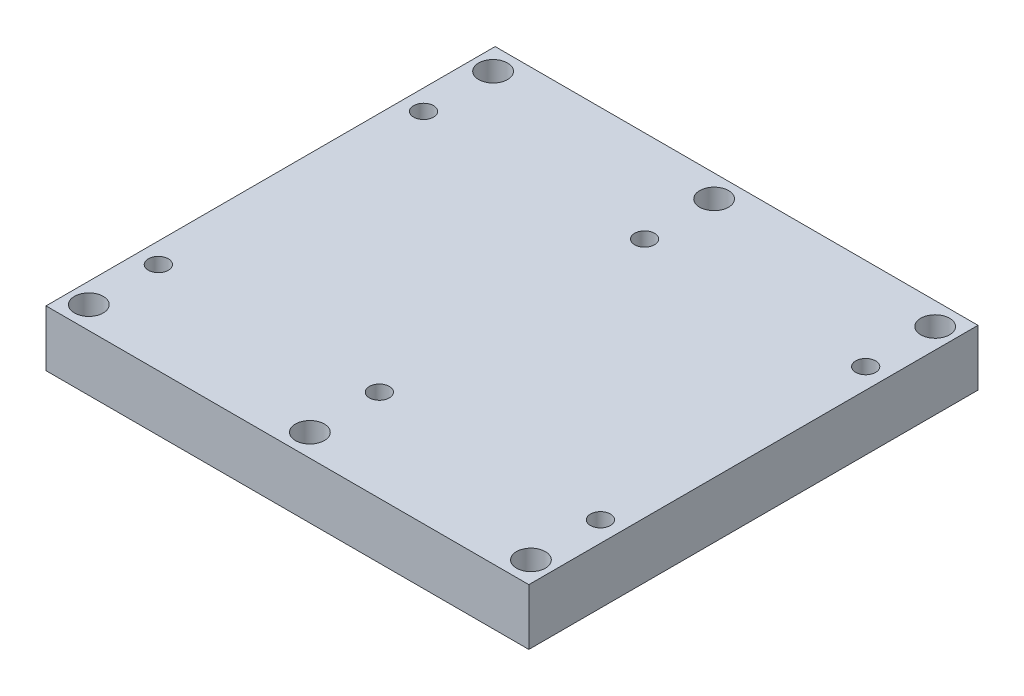
ISO-10303-21;
HEADER;
FILE_DESCRIPTION(('STEP AP214'),'2;1');
FILE_NAME('part.step','',(''),(''),'','','');
FILE_SCHEMA(('AUTOMOTIVE_DESIGN { 1 0 10303 214 1 1 1 1 }'));
ENDSEC;
DATA;
#1=APPLICATION_CONTEXT('core data for automotive mechanical design processes');
#2=APPLICATION_PROTOCOL_DEFINITION('international standard','automotive_design',2000,#1);
#3=PRODUCT_CONTEXT('',#1,'mechanical');
#4=PRODUCT('Part','Part','',(#3));
#5=PRODUCT_RELATED_PRODUCT_CATEGORY('part','',(#4));
#6=PRODUCT_DEFINITION_FORMATION('','',#4);
#7=PRODUCT_DEFINITION_CONTEXT('part definition',#1,'design');
#8=PRODUCT_DEFINITION('design','',#6,#7);
#9=PRODUCT_DEFINITION_SHAPE('','',#8);
#10=(LENGTH_UNIT() NAMED_UNIT(*) SI_UNIT(.MILLI.,.METRE.));
#11=(NAMED_UNIT(*) PLANE_ANGLE_UNIT() SI_UNIT($,.RADIAN.));
#12=(NAMED_UNIT(*) SI_UNIT($,.STERADIAN.) SOLID_ANGLE_UNIT());
#13=UNCERTAINTY_MEASURE_WITH_UNIT(LENGTH_MEASURE(1.E-05),#10,'distance_accuracy_value','');
#14=(GEOMETRIC_REPRESENTATION_CONTEXT(3) GLOBAL_UNCERTAINTY_ASSIGNED_CONTEXT((#13)) GLOBAL_UNIT_ASSIGNED_CONTEXT((#10,
#11,#12)) REPRESENTATION_CONTEXT('',''));
#15=CARTESIAN_POINT('',(0.,0.,0.));
#16=DIRECTION('',(0.,0.,1.));
#17=DIRECTION('',(1.,0.,0.));
#18=AXIS2_PLACEMENT_3D('',#15,#16,#17);
#19=CARTESIAN_POINT('',(0.,6.35,0.));
#20=DIRECTION('',(0.,-1.,0.));
#21=DIRECTION('',(0.,0.,-1.));
#22=AXIS2_PLACEMENT_3D('',#19,#20,#21);
#23=PLANE('',#22);
#24=CARTESIAN_POINT('',(0.,6.35,-22.86));
#25=DIRECTION('',(0.,1.,0.));
#26=DIRECTION('',(0.,0.,1.));
#27=AXIS2_PLACEMENT_3D('',#24,#25,#26);
#28=CIRCLE('',#27,1.63195);
#29=CARTESIAN_POINT('',(0.,6.35,-21.22805));
#30=VERTEX_POINT('',#29);
#31=EDGE_CURVE('E183',#30,#30,#28,.T.);
#32=ORIENTED_EDGE('',*,*,#31,.F.);
#33=EDGE_LOOP('',(#32));
#34=FACE_BOUND('',#33,.T.);
#35=CARTESIAN_POINT('',(25.,6.35,-22.86));
#36=DIRECTION('',(0.,1.,0.));
#37=DIRECTION('',(0.,0.,1.));
#38=AXIS2_PLACEMENT_3D('',#35,#36,#37);
#39=CIRCLE('',#38,1.63195);
#40=CARTESIAN_POINT('',(25.,6.35,-21.22805));
#41=VERTEX_POINT('',#40);
#42=EDGE_CURVE('E177',#41,#41,#39,.T.);
#43=ORIENTED_EDGE('',*,*,#42,.F.);
#44=EDGE_LOOP('',(#43));
#45=FACE_BOUND('',#44,.T.);
#46=CARTESIAN_POINT('',(-25.,6.35,14.9999908));
#47=DIRECTION('',(0.,1.,0.));
#48=DIRECTION('',(0.,0.,1.));
#49=AXIS2_PLACEMENT_3D('',#46,#47,#48);
#50=CIRCLE('',#49,1.1303);
#51=CARTESIAN_POINT('',(-25.,6.35,16.1302908));
#52=VERTEX_POINT('',#51);
#53=EDGE_CURVE('E123',#52,#52,#50,.T.);
#54=ORIENTED_EDGE('',*,*,#53,.F.);
#55=EDGE_LOOP('',(#54));
#56=FACE_BOUND('',#55,.T.);
#57=DIRECTION('',(0.,0.,-1.));
#58=VECTOR('',#57,1.);
#59=CARTESIAN_POINT('',(27.305,6.35,25.4));
#60=LINE('',#59,#58);
#61=CARTESIAN_POINT('',(27.305,6.35,25.4));
#62=VERTEX_POINT('',#61);
#63=CARTESIAN_POINT('',(27.305,6.35,-25.4));
#64=VERTEX_POINT('',#63);
#65=EDGE_CURVE('E95',#62,#64,#60,.T.);
#66=ORIENTED_EDGE('',*,*,#65,.T.);
#67=DIRECTION('',(-1.,0.,0.));
#68=VECTOR('',#67,1.);
#69=CARTESIAN_POINT('',(-27.305,6.35,-25.4));
#70=LINE('',#69,#68);
#71=CARTESIAN_POINT('',(-27.305,6.35,-25.4));
#72=VERTEX_POINT('',#71);
#73=EDGE_CURVE('E90',#64,#72,#70,.T.);
#74=ORIENTED_EDGE('',*,*,#73,.T.);
#75=DIRECTION('',(0.,0.,1.));
#76=VECTOR('',#75,1.);
#77=CARTESIAN_POINT('',(-27.305,6.35,25.4));
#78=LINE('',#77,#76);
#79=CARTESIAN_POINT('',(-27.305,6.35,25.4));
#80=VERTEX_POINT('',#79);
#81=EDGE_CURVE('E93',#72,#80,#78,.T.);
#82=ORIENTED_EDGE('',*,*,#81,.T.);
#83=DIRECTION('',(1.,0.,0.));
#84=VECTOR('',#83,1.);
#85=CARTESIAN_POINT('',(-27.305,6.35,25.4));
#86=LINE('',#85,#84);
#87=EDGE_CURVE('E60',#80,#62,#86,.T.);
#88=ORIENTED_EDGE('',*,*,#87,.T.);
#89=EDGE_LOOP('',(#66,#74,#82,#88));
#90=FACE_BOUND('',#89,.T.);
#91=CARTESIAN_POINT('',(25.0000016,6.35,14.9999908));
#92=DIRECTION('',(0.,1.,0.));
#93=DIRECTION('',(0.,0.,1.));
#94=AXIS2_PLACEMENT_3D('',#91,#92,#93);
#95=CIRCLE('',#94,1.1303);
#96=CARTESIAN_POINT('',(25.0000016,6.35,16.1302908));
#97=VERTEX_POINT('',#96);
#98=EDGE_CURVE('E129',#97,#97,#95,.T.);
#99=ORIENTED_EDGE('',*,*,#98,.F.);
#100=EDGE_LOOP('',(#99));
#101=FACE_BOUND('',#100,.T.);
#102=CARTESIAN_POINT('',(7.99999996803358E-07,6.35,14.9999908));
#103=DIRECTION('',(0.,1.,0.));
#104=DIRECTION('',(0.,0.,1.));
#105=AXIS2_PLACEMENT_3D('',#102,#103,#104);
#106=CIRCLE('',#105,1.1303);
#107=CARTESIAN_POINT('',(7.99999996803358E-07,6.35,16.1302908));
#108=VERTEX_POINT('',#107);
#109=EDGE_CURVE('E135',#108,#108,#106,.T.);
#110=ORIENTED_EDGE('',*,*,#109,.F.);
#111=EDGE_LOOP('',(#110));
#112=FACE_BOUND('',#111,.T.);
#113=CARTESIAN_POINT('',(25.0000016,6.35,-15.));
#114=DIRECTION('',(0.,1.,0.));
#115=DIRECTION('',(0.,0.,1.));
#116=AXIS2_PLACEMENT_3D('',#113,#114,#115);
#117=CIRCLE('',#116,1.1303);
#118=CARTESIAN_POINT('',(25.0000016,6.35,-13.8697));
#119=VERTEX_POINT('',#118);
#120=EDGE_CURVE('E141',#119,#119,#117,.T.);
#121=ORIENTED_EDGE('',*,*,#120,.F.);
#122=EDGE_LOOP('',(#121));
#123=FACE_BOUND('',#122,.T.);
#124=CARTESIAN_POINT('',(7.99999996803358E-07,6.35,-15.));
#125=DIRECTION('',(0.,1.,0.));
#126=DIRECTION('',(0.,0.,1.));
#127=AXIS2_PLACEMENT_3D('',#124,#125,#126);
#128=CIRCLE('',#127,1.1303);
#129=CARTESIAN_POINT('',(7.99999996803358E-07,6.35,-13.8697));
#130=VERTEX_POINT('',#129);
#131=EDGE_CURVE('E147',#130,#130,#128,.T.);
#132=ORIENTED_EDGE('',*,*,#131,.F.);
#133=EDGE_LOOP('',(#132));
#134=FACE_BOUND('',#133,.T.);
#135=CARTESIAN_POINT('',(-25.,6.35,-15.));
#136=DIRECTION('',(0.,1.,0.));
#137=DIRECTION('',(0.,0.,1.));
#138=AXIS2_PLACEMENT_3D('',#135,#136,#137);
#139=CIRCLE('',#138,1.1303);
#140=CARTESIAN_POINT('',(-25.,6.35,-13.8697));
#141=VERTEX_POINT('',#140);
#142=EDGE_CURVE('E153',#141,#141,#139,.T.);
#143=ORIENTED_EDGE('',*,*,#142,.F.);
#144=EDGE_LOOP('',(#143));
#145=FACE_BOUND('',#144,.T.);
#146=CARTESIAN_POINT('',(-24.9999999999995,6.35,22.86));
#147=DIRECTION('',(0.,1.,0.));
#148=DIRECTION('',(0.,0.,1.));
#149=AXIS2_PLACEMENT_3D('',#146,#147,#148);
#150=CIRCLE('',#149,1.63195);
#151=CARTESIAN_POINT('',(-24.9999999999995,6.35,24.49195));
#152=VERTEX_POINT('',#151);
#153=EDGE_CURVE('E159',#152,#152,#150,.T.);
#154=ORIENTED_EDGE('',*,*,#153,.F.);
#155=EDGE_LOOP('',(#154));
#156=FACE_BOUND('',#155,.T.);
#157=CARTESIAN_POINT('',(25.0000000000005,6.35,22.86));
#158=DIRECTION('',(0.,1.,0.));
#159=DIRECTION('',(0.,0.,1.));
#160=AXIS2_PLACEMENT_3D('',#157,#158,#159);
#161=CIRCLE('',#160,1.63195);
#162=CARTESIAN_POINT('',(25.0000000000005,6.35,24.49195));
#163=VERTEX_POINT('',#162);
#164=EDGE_CURVE('E165',#163,#163,#161,.T.);
#165=ORIENTED_EDGE('',*,*,#164,.F.);
#166=EDGE_LOOP('',(#165));
#167=FACE_BOUND('',#166,.T.);
#168=CARTESIAN_POINT('',(4.71844785465692E-13,6.35,22.86));
#169=DIRECTION('',(0.,1.,0.));
#170=DIRECTION('',(0.,0.,1.));
#171=AXIS2_PLACEMENT_3D('',#168,#169,#170);
#172=CIRCLE('',#171,1.63195);
#173=CARTESIAN_POINT('',(4.71844785465692E-13,6.35,24.49195));
#174=VERTEX_POINT('',#173);
#175=EDGE_CURVE('E171',#174,#174,#172,.T.);
#176=ORIENTED_EDGE('',*,*,#175,.F.);
#177=EDGE_LOOP('',(#176));
#178=FACE_BOUND('',#177,.T.);
#179=CARTESIAN_POINT('',(-25.,6.35,-22.86));
#180=DIRECTION('',(0.,1.,0.));
#181=DIRECTION('',(0.,0.,1.));
#182=AXIS2_PLACEMENT_3D('',#179,#180,#181);
#183=CIRCLE('',#182,1.63195);
#184=CARTESIAN_POINT('',(-25.,6.35,-21.22805));
#185=VERTEX_POINT('',#184);
#186=EDGE_CURVE('E189',#185,#185,#183,.T.);
#187=ORIENTED_EDGE('',*,*,#186,.F.);
#188=EDGE_LOOP('',(#187));
#189=FACE_BOUND('',#188,.T.);
#190=ADVANCED_FACE('F43',(#34,#45,#56,#90,#101,#112,#123,#134,#145,#156,#167,#178,#189),#23,.F.);
#191=CARTESIAN_POINT('',(27.305,6.35,25.4));
#192=DIRECTION('',(-1.,0.,0.));
#193=DIRECTION('',(0.,0.,1.));
#194=AXIS2_PLACEMENT_3D('',#191,#192,#193);
#195=PLANE('',#194);
#196=DIRECTION('',(0.,0.,-1.));
#197=VECTOR('',#196,1.);
#198=CARTESIAN_POINT('',(27.305,0.,25.4));
#199=LINE('',#198,#197);
#200=CARTESIAN_POINT('',(27.305,0.,25.4));
#201=VERTEX_POINT('',#200);
#202=CARTESIAN_POINT('',(27.305,0.,-25.4));
#203=VERTEX_POINT('',#202);
#204=EDGE_CURVE('E107',#201,#203,#199,.T.);
#205=ORIENTED_EDGE('',*,*,#204,.T.);
#206=DIRECTION('',(0.,-1.,0.));
#207=VECTOR('',#206,1.);
#208=CARTESIAN_POINT('',(27.305,6.35,-25.4));
#209=LINE('',#208,#207);
#210=EDGE_CURVE('E11',#64,#203,#209,.T.);
#211=ORIENTED_EDGE('',*,*,#210,.F.);
#212=ORIENTED_EDGE('',*,*,#65,.F.);
#213=DIRECTION('',(0.,-1.,0.));
#214=VECTOR('',#213,1.);
#215=CARTESIAN_POINT('',(27.305,6.35,25.4));
#216=LINE('',#215,#214);
#217=EDGE_CURVE('E103',#62,#201,#216,.T.);
#218=ORIENTED_EDGE('',*,*,#217,.T.);
#219=EDGE_LOOP('',(#205,#211,#212,#218));
#220=FACE_BOUND('',#219,.T.);
#221=ADVANCED_FACE('F45',(#220),#195,.F.);
#222=CARTESIAN_POINT('',(-27.305,6.35,-25.4));
#223=DIRECTION('',(0.,0.,1.));
#224=DIRECTION('',(1.,0.,0.));
#225=AXIS2_PLACEMENT_3D('',#222,#223,#224);
#226=PLANE('',#225);
#227=DIRECTION('',(-1.,0.,0.));
#228=VECTOR('',#227,1.);
#229=CARTESIAN_POINT('',(-27.305,0.,-25.4));
#230=LINE('',#229,#228);
#231=CARTESIAN_POINT('',(-27.305,0.,-25.4));
#232=VERTEX_POINT('',#231);
#233=EDGE_CURVE('E99',#203,#232,#230,.T.);
#234=ORIENTED_EDGE('',*,*,#233,.T.);
#235=DIRECTION('',(0.,-1.,0.));
#236=VECTOR('',#235,1.);
#237=CARTESIAN_POINT('',(-27.305,6.35,-25.4));
#238=LINE('',#237,#236);
#239=EDGE_CURVE('E52',#72,#232,#238,.T.);
#240=ORIENTED_EDGE('',*,*,#239,.F.);
#241=ORIENTED_EDGE('',*,*,#73,.F.);
#242=ORIENTED_EDGE('',*,*,#210,.T.);
#243=EDGE_LOOP('',(#234,#240,#241,#242));
#244=FACE_BOUND('',#243,.T.);
#245=ADVANCED_FACE('F98',(#244),#226,.F.);
#246=CARTESIAN_POINT('',(-27.305,6.35,25.4));
#247=DIRECTION('',(1.,0.,0.));
#248=DIRECTION('',(0.,0.,-1.));
#249=AXIS2_PLACEMENT_3D('',#246,#247,#248);
#250=PLANE('',#249);
#251=DIRECTION('',(0.,0.,1.));
#252=VECTOR('',#251,1.);
#253=CARTESIAN_POINT('',(-27.305,0.,25.4));
#254=LINE('',#253,#252);
#255=CARTESIAN_POINT('',(-27.305,0.,25.4));
#256=VERTEX_POINT('',#255);
#257=EDGE_CURVE('E77',#232,#256,#254,.T.);
#258=ORIENTED_EDGE('',*,*,#257,.T.);
#259=DIRECTION('',(0.,-1.,0.));
#260=VECTOR('',#259,1.);
#261=CARTESIAN_POINT('',(-27.305,6.35,25.4));
#262=LINE('',#261,#260);
#263=EDGE_CURVE('E100',#80,#256,#262,.T.);
#264=ORIENTED_EDGE('',*,*,#263,.F.);
#265=ORIENTED_EDGE('',*,*,#81,.F.);
#266=ORIENTED_EDGE('',*,*,#239,.T.);
#267=EDGE_LOOP('',(#258,#264,#265,#266));
#268=FACE_BOUND('',#267,.T.);
#269=ADVANCED_FACE('F101',(#268),#250,.F.);
#270=CARTESIAN_POINT('',(-27.305,6.35,25.4));
#271=DIRECTION('',(0.,0.,-1.));
#272=DIRECTION('',(-1.,0.,0.));
#273=AXIS2_PLACEMENT_3D('',#270,#271,#272);
#274=PLANE('',#273);
#275=DIRECTION('',(1.,0.,0.));
#276=VECTOR('',#275,1.);
#277=CARTESIAN_POINT('',(-27.305,0.,25.4));
#278=LINE('',#277,#276);
#279=EDGE_CURVE('E83',#256,#201,#278,.T.);
#280=ORIENTED_EDGE('',*,*,#279,.T.);
#281=ORIENTED_EDGE('',*,*,#217,.F.);
#282=ORIENTED_EDGE('',*,*,#87,.F.);
#283=ORIENTED_EDGE('',*,*,#263,.T.);
#284=EDGE_LOOP('',(#280,#281,#282,#283));
#285=FACE_BOUND('',#284,.T.);
#286=ADVANCED_FACE('F115',(#285),#274,.F.);
#287=CARTESIAN_POINT('',(0.,0.,0.));
#288=DIRECTION('',(0.,-1.,0.));
#289=DIRECTION('',(0.,0.,-1.));
#290=AXIS2_PLACEMENT_3D('',#287,#288,#289);
#291=PLANE('',#290);
#292=CARTESIAN_POINT('',(-25.,0.,-22.86));
#293=DIRECTION('',(0.,-1.,0.));
#294=DIRECTION('',(0.,0.,-1.));
#295=AXIS2_PLACEMENT_3D('',#292,#293,#294);
#296=CIRCLE('',#295,1.63195);
#297=CARTESIAN_POINT('',(-25.,0.,-24.49195));
#298=VERTEX_POINT('',#297);
#299=EDGE_CURVE('E186',#298,#298,#296,.T.);
#300=ORIENTED_EDGE('',*,*,#299,.F.);
#301=EDGE_LOOP('',(#300));
#302=FACE_BOUND('',#301,.T.);
#303=CARTESIAN_POINT('',(0.,0.,-22.86));
#304=DIRECTION('',(0.,-1.,0.));
#305=DIRECTION('',(0.,0.,-1.));
#306=AXIS2_PLACEMENT_3D('',#303,#304,#305);
#307=CIRCLE('',#306,1.63195);
#308=CARTESIAN_POINT('',(0.,0.,-24.49195));
#309=VERTEX_POINT('',#308);
#310=EDGE_CURVE('E180',#309,#309,#307,.T.);
#311=ORIENTED_EDGE('',*,*,#310,.F.);
#312=EDGE_LOOP('',(#311));
#313=FACE_BOUND('',#312,.T.);
#314=CARTESIAN_POINT('',(25.,0.,-22.86));
#315=DIRECTION('',(0.,-1.,0.));
#316=DIRECTION('',(0.,0.,-1.));
#317=AXIS2_PLACEMENT_3D('',#314,#315,#316);
#318=CIRCLE('',#317,1.63195);
#319=CARTESIAN_POINT('',(25.,0.,-24.49195));
#320=VERTEX_POINT('',#319);
#321=EDGE_CURVE('E174',#320,#320,#318,.T.);
#322=ORIENTED_EDGE('',*,*,#321,.F.);
#323=EDGE_LOOP('',(#322));
#324=FACE_BOUND('',#323,.T.);
#325=CARTESIAN_POINT('',(4.71844785465692E-13,0.,22.86));
#326=DIRECTION('',(0.,-1.,0.));
#327=DIRECTION('',(0.,0.,-1.));
#328=AXIS2_PLACEMENT_3D('',#325,#326,#327);
#329=CIRCLE('',#328,1.63195);
#330=CARTESIAN_POINT('',(4.71844785465692E-13,0.,21.22805));
#331=VERTEX_POINT('',#330);
#332=EDGE_CURVE('E168',#331,#331,#329,.T.);
#333=ORIENTED_EDGE('',*,*,#332,.F.);
#334=EDGE_LOOP('',(#333));
#335=FACE_BOUND('',#334,.T.);
#336=CARTESIAN_POINT('',(25.0000000000005,0.,22.86));
#337=DIRECTION('',(0.,-1.,0.));
#338=DIRECTION('',(0.,0.,-1.));
#339=AXIS2_PLACEMENT_3D('',#336,#337,#338);
#340=CIRCLE('',#339,1.63195);
#341=CARTESIAN_POINT('',(25.0000000000005,0.,21.22805));
#342=VERTEX_POINT('',#341);
#343=EDGE_CURVE('E162',#342,#342,#340,.T.);
#344=ORIENTED_EDGE('',*,*,#343,.F.);
#345=EDGE_LOOP('',(#344));
#346=FACE_BOUND('',#345,.T.);
#347=CARTESIAN_POINT('',(-24.9999999999995,0.,22.86));
#348=DIRECTION('',(0.,-1.,0.));
#349=DIRECTION('',(0.,0.,-1.));
#350=AXIS2_PLACEMENT_3D('',#347,#348,#349);
#351=CIRCLE('',#350,1.63195);
#352=CARTESIAN_POINT('',(-24.9999999999995,0.,21.22805));
#353=VERTEX_POINT('',#352);
#354=EDGE_CURVE('E156',#353,#353,#351,.T.);
#355=ORIENTED_EDGE('',*,*,#354,.F.);
#356=EDGE_LOOP('',(#355));
#357=FACE_BOUND('',#356,.T.);
#358=CARTESIAN_POINT('',(-25.,0.,-15.));
#359=DIRECTION('',(0.,-1.,0.));
#360=DIRECTION('',(0.,0.,-1.));
#361=AXIS2_PLACEMENT_3D('',#358,#359,#360);
#362=CIRCLE('',#361,1.1303);
#363=CARTESIAN_POINT('',(-25.,0.,-16.1303));
#364=VERTEX_POINT('',#363);
#365=EDGE_CURVE('E150',#364,#364,#362,.T.);
#366=ORIENTED_EDGE('',*,*,#365,.F.);
#367=EDGE_LOOP('',(#366));
#368=FACE_BOUND('',#367,.T.);
#369=CARTESIAN_POINT('',(7.99999996803358E-07,0.,-15.));
#370=DIRECTION('',(0.,-1.,0.));
#371=DIRECTION('',(0.,0.,-1.));
#372=AXIS2_PLACEMENT_3D('',#369,#370,#371);
#373=CIRCLE('',#372,1.1303);
#374=CARTESIAN_POINT('',(7.99999996803358E-07,0.,-16.1303));
#375=VERTEX_POINT('',#374);
#376=EDGE_CURVE('E144',#375,#375,#373,.T.);
#377=ORIENTED_EDGE('',*,*,#376,.F.);
#378=EDGE_LOOP('',(#377));
#379=FACE_BOUND('',#378,.T.);
#380=CARTESIAN_POINT('',(25.0000016,0.,-15.));
#381=DIRECTION('',(0.,-1.,0.));
#382=DIRECTION('',(0.,0.,-1.));
#383=AXIS2_PLACEMENT_3D('',#380,#381,#382);
#384=CIRCLE('',#383,1.1303);
#385=CARTESIAN_POINT('',(25.0000016,0.,-16.1303));
#386=VERTEX_POINT('',#385);
#387=EDGE_CURVE('E138',#386,#386,#384,.T.);
#388=ORIENTED_EDGE('',*,*,#387,.F.);
#389=EDGE_LOOP('',(#388));
#390=FACE_BOUND('',#389,.T.);
#391=CARTESIAN_POINT('',(7.99999996803358E-07,0.,14.9999908));
#392=DIRECTION('',(0.,-1.,0.));
#393=DIRECTION('',(0.,0.,-1.));
#394=AXIS2_PLACEMENT_3D('',#391,#392,#393);
#395=CIRCLE('',#394,1.1303);
#396=CARTESIAN_POINT('',(7.99999996803358E-07,0.,13.8696908));
#397=VERTEX_POINT('',#396);
#398=EDGE_CURVE('E132',#397,#397,#395,.T.);
#399=ORIENTED_EDGE('',*,*,#398,.F.);
#400=EDGE_LOOP('',(#399));
#401=FACE_BOUND('',#400,.T.);
#402=CARTESIAN_POINT('',(25.0000016,0.,14.9999908));
#403=DIRECTION('',(0.,-1.,0.));
#404=DIRECTION('',(0.,0.,-1.));
#405=AXIS2_PLACEMENT_3D('',#402,#403,#404);
#406=CIRCLE('',#405,1.1303);
#407=CARTESIAN_POINT('',(25.0000016,0.,13.8696908));
#408=VERTEX_POINT('',#407);
#409=EDGE_CURVE('E126',#408,#408,#406,.T.);
#410=ORIENTED_EDGE('',*,*,#409,.F.);
#411=EDGE_LOOP('',(#410));
#412=FACE_BOUND('',#411,.T.);
#413=CARTESIAN_POINT('',(-25.,0.,14.9999908));
#414=DIRECTION('',(0.,-1.,0.));
#415=DIRECTION('',(0.,0.,-1.));
#416=AXIS2_PLACEMENT_3D('',#413,#414,#415);
#417=CIRCLE('',#416,1.1303);
#418=CARTESIAN_POINT('',(-25.,0.,13.8696908));
#419=VERTEX_POINT('',#418);
#420=EDGE_CURVE('E110',#419,#419,#417,.T.);
#421=ORIENTED_EDGE('',*,*,#420,.F.);
#422=EDGE_LOOP('',(#421));
#423=FACE_BOUND('',#422,.T.);
#424=ORIENTED_EDGE('',*,*,#204,.F.);
#425=ORIENTED_EDGE('',*,*,#279,.F.);
#426=ORIENTED_EDGE('',*,*,#257,.F.);
#427=ORIENTED_EDGE('',*,*,#233,.F.);
#428=EDGE_LOOP('',(#424,#425,#426,#427));
#429=FACE_BOUND('',#428,.T.);
#430=ADVANCED_FACE('F118',(#302,#313,#324,#335,#346,#357,#368,#379,#390,#401,#412,#423,#429),
#291,.T.);
#431=CARTESIAN_POINT('',(-25.,6.35,14.9999908));
#432=DIRECTION('',(0.,1.,0.));
#433=DIRECTION('',(0.,0.,1.));
#434=AXIS2_PLACEMENT_3D('',#431,#432,#433);
#435=CYLINDRICAL_SURFACE('',#434,1.1303);
#436=ORIENTED_EDGE('',*,*,#53,.T.);
#437=EDGE_LOOP('',(#436));
#438=FACE_BOUND('',#437,.T.);
#439=ORIENTED_EDGE('',*,*,#420,.T.);
#440=EDGE_LOOP('',(#439));
#441=FACE_BOUND('',#440,.T.);
#442=ADVANCED_FACE('F206',(#438,#441),#435,.F.);
#443=CARTESIAN_POINT('',(25.0000016,6.35,14.9999908));
#444=DIRECTION('',(0.,1.,0.));
#445=DIRECTION('',(0.,0.,1.));
#446=AXIS2_PLACEMENT_3D('',#443,#444,#445);
#447=CYLINDRICAL_SURFACE('',#446,1.1303);
#448=ORIENTED_EDGE('',*,*,#98,.T.);
#449=EDGE_LOOP('',(#448));
#450=FACE_BOUND('',#449,.T.);
#451=ORIENTED_EDGE('',*,*,#409,.T.);
#452=EDGE_LOOP('',(#451));
#453=FACE_BOUND('',#452,.T.);
#454=ADVANCED_FACE('F239',(#450,#453),#447,.F.);
#455=CARTESIAN_POINT('',(7.99999996803358E-07,6.35,14.9999908));
#456=DIRECTION('',(0.,1.,0.));
#457=DIRECTION('',(0.,0.,1.));
#458=AXIS2_PLACEMENT_3D('',#455,#456,#457);
#459=CYLINDRICAL_SURFACE('',#458,1.1303);
#460=ORIENTED_EDGE('',*,*,#109,.T.);
#461=EDGE_LOOP('',(#460));
#462=FACE_BOUND('',#461,.T.);
#463=ORIENTED_EDGE('',*,*,#398,.T.);
#464=EDGE_LOOP('',(#463));
#465=FACE_BOUND('',#464,.T.);
#466=ADVANCED_FACE('F248',(#462,#465),#459,.F.);
#467=CARTESIAN_POINT('',(25.0000016,6.35,-15.));
#468=DIRECTION('',(0.,1.,0.));
#469=DIRECTION('',(0.,0.,1.));
#470=AXIS2_PLACEMENT_3D('',#467,#468,#469);
#471=CYLINDRICAL_SURFACE('',#470,1.1303);
#472=ORIENTED_EDGE('',*,*,#120,.T.);
#473=EDGE_LOOP('',(#472));
#474=FACE_BOUND('',#473,.T.);
#475=ORIENTED_EDGE('',*,*,#387,.T.);
#476=EDGE_LOOP('',(#475));
#477=FACE_BOUND('',#476,.T.);
#478=ADVANCED_FACE('F255',(#474,#477),#471,.F.);
#479=CARTESIAN_POINT('',(7.99999996803358E-07,6.35,-15.));
#480=DIRECTION('',(0.,1.,0.));
#481=DIRECTION('',(0.,0.,1.));
#482=AXIS2_PLACEMENT_3D('',#479,#480,#481);
#483=CYLINDRICAL_SURFACE('',#482,1.1303);
#484=ORIENTED_EDGE('',*,*,#131,.T.);
#485=EDGE_LOOP('',(#484));
#486=FACE_BOUND('',#485,.T.);
#487=ORIENTED_EDGE('',*,*,#376,.T.);
#488=EDGE_LOOP('',(#487));
#489=FACE_BOUND('',#488,.T.);
#490=ADVANCED_FACE('F262',(#486,#489),#483,.F.);
#491=CARTESIAN_POINT('',(-25.,6.35,-15.));
#492=DIRECTION('',(0.,1.,0.));
#493=DIRECTION('',(0.,0.,1.));
#494=AXIS2_PLACEMENT_3D('',#491,#492,#493);
#495=CYLINDRICAL_SURFACE('',#494,1.1303);
#496=ORIENTED_EDGE('',*,*,#142,.T.);
#497=EDGE_LOOP('',(#496));
#498=FACE_BOUND('',#497,.T.);
#499=ORIENTED_EDGE('',*,*,#365,.T.);
#500=EDGE_LOOP('',(#499));
#501=FACE_BOUND('',#500,.T.);
#502=ADVANCED_FACE('F270',(#498,#501),#495,.F.);
#503=CARTESIAN_POINT('',(-24.9999999999995,6.35,22.86));
#504=DIRECTION('',(0.,1.,0.));
#505=DIRECTION('',(0.,0.,1.));
#506=AXIS2_PLACEMENT_3D('',#503,#504,#505);
#507=CYLINDRICAL_SURFACE('',#506,1.63195);
#508=ORIENTED_EDGE('',*,*,#153,.T.);
#509=EDGE_LOOP('',(#508));
#510=FACE_BOUND('',#509,.T.);
#511=ORIENTED_EDGE('',*,*,#354,.T.);
#512=EDGE_LOOP('',(#511));
#513=FACE_BOUND('',#512,.T.);
#514=ADVANCED_FACE('F278',(#510,#513),#507,.F.);
#515=CARTESIAN_POINT('',(25.0000000000005,6.35,22.86));
#516=DIRECTION('',(0.,1.,0.));
#517=DIRECTION('',(0.,0.,1.));
#518=AXIS2_PLACEMENT_3D('',#515,#516,#517);
#519=CYLINDRICAL_SURFACE('',#518,1.63195);
#520=ORIENTED_EDGE('',*,*,#164,.T.);
#521=EDGE_LOOP('',(#520));
#522=FACE_BOUND('',#521,.T.);
#523=ORIENTED_EDGE('',*,*,#343,.T.);
#524=EDGE_LOOP('',(#523));
#525=FACE_BOUND('',#524,.T.);
#526=ADVANCED_FACE('F285',(#522,#525),#519,.F.);
#527=CARTESIAN_POINT('',(4.71844785465692E-13,6.35,22.86));
#528=DIRECTION('',(0.,1.,0.));
#529=DIRECTION('',(0.,0.,1.));
#530=AXIS2_PLACEMENT_3D('',#527,#528,#529);
#531=CYLINDRICAL_SURFACE('',#530,1.63195);
#532=ORIENTED_EDGE('',*,*,#175,.T.);
#533=EDGE_LOOP('',(#532));
#534=FACE_BOUND('',#533,.T.);
#535=ORIENTED_EDGE('',*,*,#332,.T.);
#536=EDGE_LOOP('',(#535));
#537=FACE_BOUND('',#536,.T.);
#538=ADVANCED_FACE('F293',(#534,#537),#531,.F.);
#539=CARTESIAN_POINT('',(25.,6.35,-22.86));
#540=DIRECTION('',(0.,1.,0.));
#541=DIRECTION('',(0.,0.,1.));
#542=AXIS2_PLACEMENT_3D('',#539,#540,#541);
#543=CYLINDRICAL_SURFACE('',#542,1.63195);
#544=ORIENTED_EDGE('',*,*,#42,.T.);
#545=EDGE_LOOP('',(#544));
#546=FACE_BOUND('',#545,.T.);
#547=ORIENTED_EDGE('',*,*,#321,.T.);
#548=EDGE_LOOP('',(#547));
#549=FACE_BOUND('',#548,.T.);
#550=ADVANCED_FACE('F301',(#546,#549),#543,.F.);
#551=CARTESIAN_POINT('',(0.,6.35,-22.86));
#552=DIRECTION('',(0.,1.,0.));
#553=DIRECTION('',(0.,0.,1.));
#554=AXIS2_PLACEMENT_3D('',#551,#552,#553);
#555=CYLINDRICAL_SURFACE('',#554,1.63195);
#556=ORIENTED_EDGE('',*,*,#31,.T.);
#557=EDGE_LOOP('',(#556));
#558=FACE_BOUND('',#557,.T.);
#559=ORIENTED_EDGE('',*,*,#310,.T.);
#560=EDGE_LOOP('',(#559));
#561=FACE_BOUND('',#560,.T.);
#562=ADVANCED_FACE('F309',(#558,#561),#555,.F.);
#563=CARTESIAN_POINT('',(-25.,6.35,-22.86));
#564=DIRECTION('',(0.,1.,0.));
#565=DIRECTION('',(0.,0.,1.));
#566=AXIS2_PLACEMENT_3D('',#563,#564,#565);
#567=CYLINDRICAL_SURFACE('',#566,1.63195);
#568=ORIENTED_EDGE('',*,*,#186,.T.);
#569=EDGE_LOOP('',(#568));
#570=FACE_BOUND('',#569,.T.);
#571=ORIENTED_EDGE('',*,*,#299,.T.);
#572=EDGE_LOOP('',(#571));
#573=FACE_BOUND('',#572,.T.);
#574=ADVANCED_FACE('F193',(#570,#573),#567,.F.);
#575=CLOSED_SHELL('',(#190,#221,#245,#269,#286,#430,#442,#454,#466,#478,#490,#502,#514,#526,
#538,#550,#562,#574));
#576=MANIFOLD_SOLID_BREP('B2',#575);
#577=ADVANCED_BREP_SHAPE_REPRESENTATION('',(#18,#576),#14);
#578=SHAPE_DEFINITION_REPRESENTATION(#9,#577);
ENDSEC;
END-ISO-10303-21;
